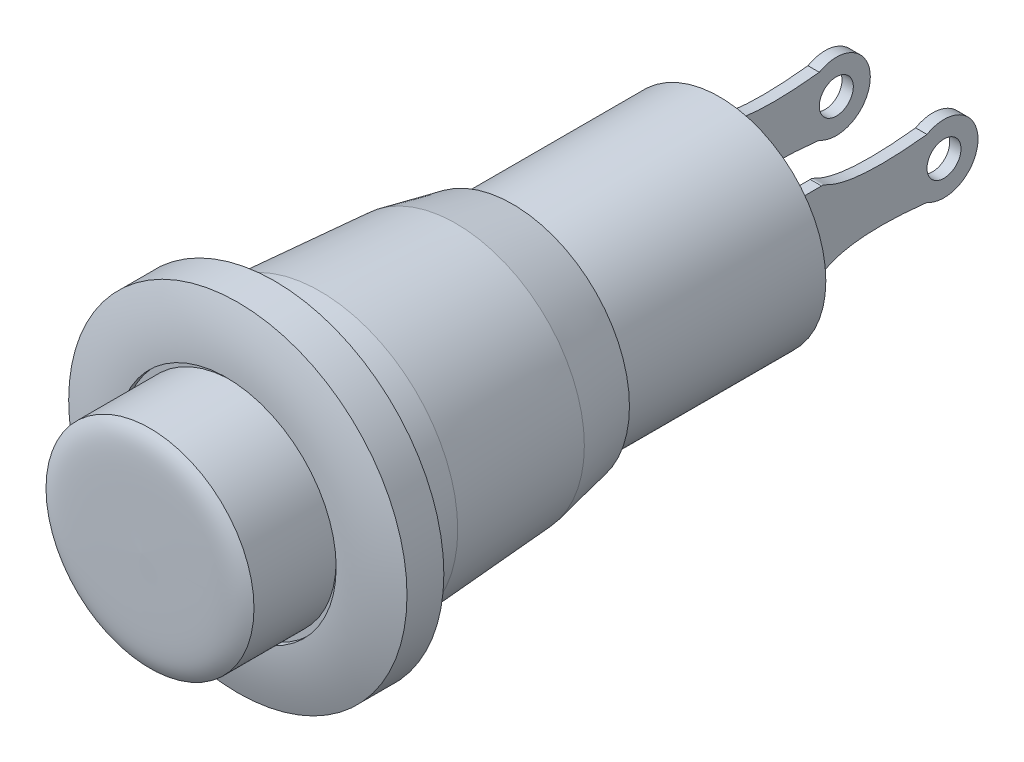
ISO-10303-21;
HEADER;
FILE_DESCRIPTION(('STEP AP214'),'2;1');
FILE_NAME('part.step','',(''),(''),'','','');
FILE_SCHEMA(('AUTOMOTIVE_DESIGN { 1 0 10303 214 1 1 1 1 }'));
ENDSEC;
DATA;
#1=APPLICATION_CONTEXT('core data for automotive mechanical design processes');
#2=APPLICATION_PROTOCOL_DEFINITION('international standard','automotive_design',2000,#1);
#3=PRODUCT_CONTEXT('',#1,'mechanical');
#4=PRODUCT('Part','Part','',(#3));
#5=PRODUCT_RELATED_PRODUCT_CATEGORY('part','',(#4));
#6=PRODUCT_DEFINITION_FORMATION('','',#4);
#7=PRODUCT_DEFINITION_CONTEXT('part definition',#1,'design');
#8=PRODUCT_DEFINITION('design','',#6,#7);
#9=PRODUCT_DEFINITION_SHAPE('','',#8);
#10=(LENGTH_UNIT() NAMED_UNIT(*) SI_UNIT(.MILLI.,.METRE.));
#11=(NAMED_UNIT(*) PLANE_ANGLE_UNIT() SI_UNIT($,.RADIAN.));
#12=(NAMED_UNIT(*) SI_UNIT($,.STERADIAN.) SOLID_ANGLE_UNIT());
#13=UNCERTAINTY_MEASURE_WITH_UNIT(LENGTH_MEASURE(1.E-05),#10,'distance_accuracy_value','');
#14=(GEOMETRIC_REPRESENTATION_CONTEXT(3) GLOBAL_UNCERTAINTY_ASSIGNED_CONTEXT((#13)) GLOBAL_UNIT_ASSIGNED_CONTEXT((#10,
#11,#12)) REPRESENTATION_CONTEXT('',''));
#15=CARTESIAN_POINT('',(0.,0.,0.));
#16=DIRECTION('',(0.,0.,1.));
#17=DIRECTION('',(1.,0.,0.));
#18=AXIS2_PLACEMENT_3D('',#15,#16,#17);
#19=CARTESIAN_POINT('',(-2.1,0.,-19.25615950335));
#20=DIRECTION('',(-1.,0.,0.));
#21=DIRECTION('',(0.,1.,0.));
#22=AXIS2_PLACEMENT_3D('',#19,#20,#21);
#23=PLANE('',#22);
#24=CARTESIAN_POINT('',(-2.1,0.,-21.52));
#25=DIRECTION('',(1.,0.,0.));
#26=DIRECTION('',(0.,1.,0.));
#27=AXIS2_PLACEMENT_3D('',#24,#25,#26);
#28=CIRCLE('',#27,0.6);
#29=CARTESIAN_POINT('',(-2.1,0.6,-21.52));
#30=VERTEX_POINT('',#29);
#31=EDGE_CURVE('P0_E10',#30,#30,#28,.T.);
#32=ORIENTED_EDGE('',*,*,#31,.T.);
#33=EDGE_LOOP('',(#32));
#34=FACE_BOUND('',#33,.T.);
#35=CARTESIAN_POINT('',(-2.1,-1.325,-17.2));
#36=CARTESIAN_POINT('',(-2.1,-1.393905,-17.370288));
#37=CARTESIAN_POINT('',(-2.1,-0.682112,-17.725716));
#38=CARTESIAN_POINT('',(-2.1,-1.039230484559,-20.91999999999));
#39=B_SPLINE_CURVE_WITH_KNOTS('',3,(#35,#36,#37,#38),.UNSPECIFIED.,.F.,.F.,(4,4),(0.,1.),.UNSPECIFIED.);
#40=CARTESIAN_POINT('',(-2.1,-1.325,-17.2));
#41=VERTEX_POINT('',#40);
#42=CARTESIAN_POINT('',(-2.1,-1.03923048455,-20.91999999999));
#43=VERTEX_POINT('',#42);
#44=EDGE_CURVE('P0_E19',#41,#43,#39,.T.);
#45=ORIENTED_EDGE('',*,*,#44,.F.);
#46=DIRECTION('',(0.,0.,-1.));
#47=VECTOR('',#46,1.);
#48=CARTESIAN_POINT('',(-2.1,-1.325,-15.7));
#49=LINE('',#48,#47);
#50=CARTESIAN_POINT('',(-2.1,-1.325,-15.7));
#51=VERTEX_POINT('',#50);
#52=EDGE_CURVE('P0_E146',#51,#41,#49,.T.);
#53=ORIENTED_EDGE('',*,*,#52,.F.);
#54=DIRECTION('',(0.,1.,0.));
#55=VECTOR('',#54,1.);
#56=CARTESIAN_POINT('',(-2.1,-1.325,-15.7));
#57=LINE('',#56,#55);
#58=CARTESIAN_POINT('',(-2.1,1.325,-15.7));
#59=VERTEX_POINT('',#58);
#60=EDGE_CURVE('P0_E134',#51,#59,#57,.T.);
#61=ORIENTED_EDGE('',*,*,#60,.T.);
#62=DIRECTION('',(0.,0.,-1.));
#63=VECTOR('',#62,1.);
#64=CARTESIAN_POINT('',(-2.1,1.325,-15.7));
#65=LINE('',#64,#63);
#66=CARTESIAN_POINT('',(-2.1,1.325,-17.2));
#67=VERTEX_POINT('',#66);
#68=EDGE_CURVE('P0_E74',#59,#67,#65,.T.);
#69=ORIENTED_EDGE('',*,*,#68,.T.);
#70=CARTESIAN_POINT('',(-2.1,1.325,-17.2));
#71=CARTESIAN_POINT('',(-2.1,1.393905,-17.370288));
#72=CARTESIAN_POINT('',(-2.1,0.682112,-17.725716));
#73=CARTESIAN_POINT('',(-2.1,1.039230484559,-20.91999999999));
#74=B_SPLINE_CURVE_WITH_KNOTS('',3,(#70,#71,#72,#73),.UNSPECIFIED.,.F.,.F.,(4,4),(0.,1.),.UNSPECIFIED.);
#75=CARTESIAN_POINT('',(-2.1,1.03923048455,-20.91999999999));
#76=VERTEX_POINT('',#75);
#77=EDGE_CURVE('P0_E118',#67,#76,#74,.T.);
#78=ORIENTED_EDGE('',*,*,#77,.T.);
#79=CARTESIAN_POINT('',(-2.1,0.,-21.52));
#80=DIRECTION('',(1.,0.,0.));
#81=DIRECTION('',(0.,1.,0.));
#82=AXIS2_PLACEMENT_3D('',#79,#80,#81);
#83=CIRCLE('',#82,1.2);
#84=EDGE_CURVE('P0_E105',#43,#76,#83,.T.);
#85=ORIENTED_EDGE('',*,*,#84,.F.);
#86=EDGE_LOOP('',(#45,#53,#61,#69,#78,#85));
#87=FACE_BOUND('',#86,.T.);
#88=ADVANCED_FACE('P0_F16',(#34,#87),#23,.T.);
#89=CARTESIAN_POINT('',(-1.7,0.,-19.25615950335));
#90=DIRECTION('',(-1.,0.,0.));
#91=DIRECTION('',(0.,1.,0.));
#92=AXIS2_PLACEMENT_3D('',#89,#90,#91);
#93=PLANE('',#92);
#94=CARTESIAN_POINT('',(-1.7,0.,-21.52));
#95=DIRECTION('',(1.,0.,0.));
#96=DIRECTION('',(0.,1.,0.));
#97=AXIS2_PLACEMENT_3D('',#94,#95,#96);
#98=CIRCLE('',#97,0.6);
#99=CARTESIAN_POINT('',(-1.7,0.6,-21.52));
#100=VERTEX_POINT('',#99);
#101=EDGE_CURVE('P0_E152',#100,#100,#98,.T.);
#102=ORIENTED_EDGE('',*,*,#101,.F.);
#103=EDGE_LOOP('',(#102));
#104=FACE_BOUND('',#103,.T.);
#105=CARTESIAN_POINT('',(-1.7,0.,-21.52));
#106=DIRECTION('',(1.,0.,0.));
#107=DIRECTION('',(0.,1.,0.));
#108=AXIS2_PLACEMENT_3D('',#105,#106,#107);
#109=CIRCLE('',#108,1.2);
#110=CARTESIAN_POINT('',(-1.7,-1.03923048455,-20.91999999999));
#111=VERTEX_POINT('',#110);
#112=CARTESIAN_POINT('',(-1.7,1.03923048455,-20.91999999999));
#113=VERTEX_POINT('',#112);
#114=EDGE_CURVE('P0_E117',#111,#113,#109,.T.);
#115=ORIENTED_EDGE('',*,*,#114,.T.);
#116=CARTESIAN_POINT('',(-1.7,1.325,-17.2));
#117=CARTESIAN_POINT('',(-1.7,1.393905,-17.370288));
#118=CARTESIAN_POINT('',(-1.7,0.682112,-17.725716));
#119=CARTESIAN_POINT('',(-1.7,1.039230484559,-20.91999999999));
#120=B_SPLINE_CURVE_WITH_KNOTS('',3,(#116,#117,#118,#119),.UNSPECIFIED.,.F.,.F.,(4,4),(0.,1.),.UNSPECIFIED.);
#121=CARTESIAN_POINT('',(-1.7,1.325,-17.2));
#122=VERTEX_POINT('',#121);
#123=EDGE_CURVE('P0_E64',#122,#113,#120,.T.);
#124=ORIENTED_EDGE('',*,*,#123,.F.);
#125=DIRECTION('',(0.,0.,-1.));
#126=VECTOR('',#125,1.);
#127=CARTESIAN_POINT('',(-1.7,1.325,-15.7));
#128=LINE('',#127,#126);
#129=CARTESIAN_POINT('',(-1.7,1.325,-15.7));
#130=VERTEX_POINT('',#129);
#131=EDGE_CURVE('P0_E82',#130,#122,#128,.T.);
#132=ORIENTED_EDGE('',*,*,#131,.F.);
#133=DIRECTION('',(0.,1.,0.));
#134=VECTOR('',#133,1.);
#135=CARTESIAN_POINT('',(-1.7,-1.325,-15.7));
#136=LINE('',#135,#134);
#137=CARTESIAN_POINT('',(-1.7,-1.325,-15.7));
#138=VERTEX_POINT('',#137);
#139=EDGE_CURVE('P0_E145',#138,#130,#136,.T.);
#140=ORIENTED_EDGE('',*,*,#139,.F.);
#141=DIRECTION('',(0.,0.,-1.));
#142=VECTOR('',#141,1.);
#143=CARTESIAN_POINT('',(-1.7,-1.325,-15.7));
#144=LINE('',#143,#142);
#145=CARTESIAN_POINT('',(-1.7,-1.325,-17.2));
#146=VERTEX_POINT('',#145);
#147=EDGE_CURVE('P0_E142',#138,#146,#144,.T.);
#148=ORIENTED_EDGE('',*,*,#147,.T.);
#149=CARTESIAN_POINT('',(-1.7,-1.325,-17.2));
#150=CARTESIAN_POINT('',(-1.7,-1.393905,-17.370288));
#151=CARTESIAN_POINT('',(-1.7,-0.682112,-17.725716));
#152=CARTESIAN_POINT('',(-1.7,-1.039230484559,-20.91999999999));
#153=B_SPLINE_CURVE_WITH_KNOTS('',3,(#149,#150,#151,#152),.UNSPECIFIED.,.F.,.F.,(4,4),(0.,1.),.UNSPECIFIED.);
#154=EDGE_CURVE('P0_E160',#146,#111,#153,.T.);
#155=ORIENTED_EDGE('',*,*,#154,.T.);
#156=EDGE_LOOP('',(#115,#124,#132,#140,#148,#155));
#157=FACE_BOUND('',#156,.T.);
#158=ADVANCED_FACE('P0_F202',(#104,#157),#93,.F.);
#159=CARTESIAN_POINT('',(-1.7,0.,-21.52));
#160=DIRECTION('',(1.,0.,0.));
#161=DIRECTION('',(0.,1.,0.));
#162=AXIS2_PLACEMENT_3D('',#159,#160,#161);
#163=CYLINDRICAL_SURFACE('',#162,0.6);
#164=ORIENTED_EDGE('',*,*,#101,.T.);
#165=DIRECTION('',(-1.,0.,0.));
#166=VECTOR('',#165,1.);
#167=CARTESIAN_POINT('',(-1.7,0.6,-21.52));
#168=LINE('',#167,#166);
#169=EDGE_CURVE('P0_E28',#100,#30,#168,.T.);
#170=ORIENTED_EDGE('',*,*,#169,.T.);
#171=ORIENTED_EDGE('',*,*,#31,.F.);
#172=ORIENTED_EDGE('',*,*,#169,.F.);
#173=EDGE_LOOP('',(#164,#170,#171,#172));
#174=FACE_BOUND('',#173,.T.);
#175=ADVANCED_FACE('P0_F204',(#174),#163,.F.);
#176=CARTESIAN_POINT('',(-1.7,0.,-21.52));
#177=DIRECTION('',(1.,0.,0.));
#178=DIRECTION('',(0.,1.,0.));
#179=AXIS2_PLACEMENT_3D('',#176,#177,#178);
#180=CYLINDRICAL_SURFACE('',#179,1.2);
#181=DIRECTION('',(-1.,0.,0.));
#182=VECTOR('',#181,1.);
#183=CARTESIAN_POINT('',(-1.7,-1.03923048455,-20.91999999999));
#184=LINE('',#183,#182);
#185=EDGE_CURVE('P0_E112',#111,#43,#184,.T.);
#186=ORIENTED_EDGE('',*,*,#185,.T.);
#187=ORIENTED_EDGE('',*,*,#84,.T.);
#188=DIRECTION('',(-1.,0.,0.));
#189=VECTOR('',#188,1.);
#190=CARTESIAN_POINT('',(-1.7,1.03923048455,-20.91999999999));
#191=LINE('',#190,#189);
#192=EDGE_CURVE('P0_E110',#113,#76,#191,.T.);
#193=ORIENTED_EDGE('',*,*,#192,.F.);
#194=ORIENTED_EDGE('',*,*,#114,.F.);
#195=EDGE_LOOP('',(#186,#187,#193,#194));
#196=FACE_BOUND('',#195,.T.);
#197=ADVANCED_FACE('P0_F107',(#196),#180,.T.);
#198=CARTESIAN_POINT('',(-1.7,1.325,-17.2));
#199=CARTESIAN_POINT('',(-1.7,1.393905,-17.370288));
#200=CARTESIAN_POINT('',(-1.7,0.682112,-17.725716));
#201=CARTESIAN_POINT('',(-1.7,1.039230484559,-20.91999999999));
#202=(BOUNDED_CURVE() B_SPLINE_CURVE(3,(#198,#199,#200,#201),.UNSPECIFIED.,.F.,
.F.) B_SPLINE_CURVE_WITH_KNOTS((4,4),(0.,1.),
.UNSPECIFIED.) CURVE() GEOMETRIC_REPRESENTATION_ITEM() RATIONAL_B_SPLINE_CURVE((1.,1.,1.,1.)) REPRESENTATION_ITEM(''));
#203=DIRECTION('',(1.,0.,0.));
#204=VECTOR('',#203,1.);
#205=SURFACE_OF_LINEAR_EXTRUSION('',#202,#204);
#206=ORIENTED_EDGE('',*,*,#123,.T.);
#207=ORIENTED_EDGE('',*,*,#192,.T.);
#208=ORIENTED_EDGE('',*,*,#77,.F.);
#209=DIRECTION('',(-1.,0.,0.));
#210=VECTOR('',#209,1.);
#211=CARTESIAN_POINT('',(-1.7,1.325,-17.2));
#212=LINE('',#211,#210);
#213=EDGE_CURVE('P0_E149',#122,#67,#212,.T.);
#214=ORIENTED_EDGE('',*,*,#213,.F.);
#215=EDGE_LOOP('',(#206,#207,#208,#214));
#216=FACE_BOUND('',#215,.T.);
#217=ADVANCED_FACE('P0_F123',(#216),#205,.F.);
#218=CARTESIAN_POINT('',(-1.7,1.325,-15.7));
#219=DIRECTION('',(0.,1.,0.));
#220=DIRECTION('',(1.,0.,0.));
#221=AXIS2_PLACEMENT_3D('',#218,#219,#220);
#222=PLANE('',#221);
#223=ORIENTED_EDGE('',*,*,#131,.T.);
#224=ORIENTED_EDGE('',*,*,#213,.T.);
#225=ORIENTED_EDGE('',*,*,#68,.F.);
#226=DIRECTION('',(-1.,0.,0.));
#227=VECTOR('',#226,1.);
#228=CARTESIAN_POINT('',(-1.7,1.325,-15.7));
#229=LINE('',#228,#227);
#230=EDGE_CURVE('P0_E137',#130,#59,#229,.T.);
#231=ORIENTED_EDGE('',*,*,#230,.F.);
#232=EDGE_LOOP('',(#223,#224,#225,#231));
#233=FACE_BOUND('',#232,.T.);
#234=ADVANCED_FACE('P0_F225',(#233),#222,.T.);
#235=CARTESIAN_POINT('',(-1.7,-1.325,-15.7));
#236=DIRECTION('',(0.,0.,1.));
#237=DIRECTION('',(0.,-1.,0.));
#238=AXIS2_PLACEMENT_3D('',#235,#236,#237);
#239=PLANE('',#238);
#240=ORIENTED_EDGE('',*,*,#139,.T.);
#241=ORIENTED_EDGE('',*,*,#230,.T.);
#242=ORIENTED_EDGE('',*,*,#60,.F.);
#243=DIRECTION('',(-1.,0.,0.));
#244=VECTOR('',#243,1.);
#245=CARTESIAN_POINT('',(-1.7,-1.325,-15.7));
#246=LINE('',#245,#244);
#247=EDGE_CURVE('P0_E133',#138,#51,#246,.T.);
#248=ORIENTED_EDGE('',*,*,#247,.F.);
#249=EDGE_LOOP('',(#240,#241,#242,#248));
#250=FACE_BOUND('',#249,.T.);
#251=ADVANCED_FACE('P0_F196',(#250),#239,.T.);
#252=CARTESIAN_POINT('',(-1.7,-1.325,-15.7));
#253=DIRECTION('',(0.,1.,0.));
#254=DIRECTION('',(1.,0.,0.));
#255=AXIS2_PLACEMENT_3D('',#252,#253,#254);
#256=PLANE('',#255);
#257=ORIENTED_EDGE('',*,*,#247,.T.);
#258=ORIENTED_EDGE('',*,*,#52,.T.);
#259=DIRECTION('',(-1.,0.,0.));
#260=VECTOR('',#259,1.);
#261=CARTESIAN_POINT('',(-1.7,-1.325,-17.2));
#262=LINE('',#261,#260);
#263=EDGE_CURVE('P0_E138',#146,#41,#262,.T.);
#264=ORIENTED_EDGE('',*,*,#263,.F.);
#265=ORIENTED_EDGE('',*,*,#147,.F.);
#266=EDGE_LOOP('',(#257,#258,#264,#265));
#267=FACE_BOUND('',#266,.T.);
#268=ADVANCED_FACE('P0_F192',(#267),#256,.F.);
#269=CARTESIAN_POINT('',(-1.7,-1.325,-17.2));
#270=CARTESIAN_POINT('',(-1.7,-1.393905,-17.370288));
#271=CARTESIAN_POINT('',(-1.7,-0.682112,-17.725716));
#272=CARTESIAN_POINT('',(-1.7,-1.039230484559,-20.91999999999));
#273=(BOUNDED_CURVE() B_SPLINE_CURVE(3,(#269,#270,#271,#272),.UNSPECIFIED.,.F.,
.F.) B_SPLINE_CURVE_WITH_KNOTS((4,4),(0.,1.),
.UNSPECIFIED.) CURVE() GEOMETRIC_REPRESENTATION_ITEM() RATIONAL_B_SPLINE_CURVE((1.,1.,1.,1.)) REPRESENTATION_ITEM(''));
#274=DIRECTION('',(1.,0.,0.));
#275=VECTOR('',#274,1.);
#276=SURFACE_OF_LINEAR_EXTRUSION('',#273,#275);
#277=ORIENTED_EDGE('',*,*,#263,.T.);
#278=ORIENTED_EDGE('',*,*,#44,.T.);
#279=ORIENTED_EDGE('',*,*,#185,.F.);
#280=ORIENTED_EDGE('',*,*,#154,.F.);
#281=EDGE_LOOP('',(#277,#278,#279,#280));
#282=FACE_BOUND('',#281,.T.);
#283=ADVANCED_FACE('P0_F200',(#282),#276,.T.);
#284=CLOSED_SHELL('',(#88,#158,#175,#197,#217,#234,#251,#268,#283));
#285=MANIFOLD_SOLID_BREP('P0_B1',#284);
#286=CARTESIAN_POINT('',(0.,0.,4.7));
#287=CARTESIAN_POINT('',(2.840957,0.,4.660466));
#288=CARTESIAN_POINT('',(3.116079,0.,4.739611));
#289=CARTESIAN_POINT('',(3.67,0.,4.4));
#290=(BOUNDED_CURVE() B_SPLINE_CURVE(3,(#286,#287,#288,#289),.UNSPECIFIED.,.F.,
.F.) B_SPLINE_CURVE_WITH_KNOTS((4,4),(0.,1.),
.UNSPECIFIED.) CURVE() GEOMETRIC_REPRESENTATION_ITEM() RATIONAL_B_SPLINE_CURVE((1.,1.,1.,1.)) REPRESENTATION_ITEM(''));
#291=CARTESIAN_POINT('',(0.,0.,0.));
#292=DIRECTION('',(0.,0.,1.));
#293=AXIS1_PLACEMENT('',#291,#292);
#294=SURFACE_OF_REVOLUTION('',#290,#293);
#295=CARTESIAN_POINT('',(0.,0.,4.7));
#296=CARTESIAN_POINT('',(2.840957,0.,4.660466));
#297=CARTESIAN_POINT('',(3.116079,0.,4.739611));
#298=CARTESIAN_POINT('',(3.67,0.,4.4));
#299=B_SPLINE_CURVE_WITH_KNOTS('',3,(#295,#296,#297,#298),.UNSPECIFIED.,.F.,.F.,(4,4),(0.,1.),.UNSPECIFIED.);
#300=CARTESIAN_POINT('',(0.,0.,4.7));
#301=VERTEX_POINT('',#300);
#302=CARTESIAN_POINT('',(3.67,0.,4.4));
#303=VERTEX_POINT('',#302);
#304=EDGE_CURVE('P1_E11',#301,#303,#299,.T.);
#305=ORIENTED_EDGE('',*,*,#304,.T.);
#306=CARTESIAN_POINT('',(0.,0.,4.4));
#307=DIRECTION('',(0.,0.,-1.));
#308=DIRECTION('',(1.,0.,0.));
#309=AXIS2_PLACEMENT_3D('',#306,#307,#308);
#310=CIRCLE('',#309,3.67);
#311=EDGE_CURVE('P1_E29',#303,#303,#310,.T.);
#312=ORIENTED_EDGE('',*,*,#311,.F.);
#313=ORIENTED_EDGE('',*,*,#304,.F.);
#314=EDGE_LOOP('',(#305,#312,#313));
#315=FACE_BOUND('',#314,.T.);
#316=ADVANCED_FACE('P1_F17',(#315),#294,.F.);
#317=CARTESIAN_POINT('',(0.,0.,1.5));
#318=DIRECTION('',(0.,0.,1.));
#319=DIRECTION('',(1.,0.,0.));
#320=AXIS2_PLACEMENT_3D('',#317,#318,#319);
#321=CYLINDRICAL_SURFACE('',#320,3.67);
#322=DIRECTION('',(0.,0.,1.));
#323=VECTOR('',#322,1.);
#324=CARTESIAN_POINT('',(3.67,0.,1.5));
#325=LINE('',#324,#323);
#326=CARTESIAN_POINT('',(3.67,0.,1.5));
#327=VERTEX_POINT('',#326);
#328=EDGE_CURVE('P1_E47',#327,#303,#325,.T.);
#329=ORIENTED_EDGE('',*,*,#328,.T.);
#330=ORIENTED_EDGE('',*,*,#311,.T.);
#331=ORIENTED_EDGE('',*,*,#328,.F.);
#332=CARTESIAN_POINT('',(0.,0.,1.5));
#333=DIRECTION('',(0.,0.,-1.));
#334=DIRECTION('',(1.,0.,0.));
#335=AXIS2_PLACEMENT_3D('',#332,#333,#334);
#336=CIRCLE('',#335,3.67);
#337=EDGE_CURVE('P1_E49',#327,#327,#336,.T.);
#338=ORIENTED_EDGE('',*,*,#337,.F.);
#339=EDGE_LOOP('',(#329,#330,#331,#338));
#340=FACE_BOUND('',#339,.T.);
#341=ADVANCED_FACE('P1_F19',(#340),#321,.T.);
#342=CARTESIAN_POINT('',(0.,0.,1.5));
#343=DIRECTION('',(0.,0.,-1.));
#344=DIRECTION('',(0.,-1.,0.));
#345=AXIS2_PLACEMENT_3D('',#342,#343,#344);
#346=PLANE('',#345);
#347=ORIENTED_EDGE('',*,*,#337,.T.);
#348=EDGE_LOOP('',(#347));
#349=FACE_BOUND('',#348,.T.);
#350=ADVANCED_FACE('P1_F53',(#349),#346,.T.);
#351=CLOSED_SHELL('',(#316,#341,#350));
#352=MANIFOLD_SOLID_BREP('P1_B1',#351);
#353=CARTESIAN_POINT('',(2.1,0.,-19.25615950335));
#354=DIRECTION('',(1.,0.,0.));
#355=DIRECTION('',(0.,-1.,0.));
#356=AXIS2_PLACEMENT_3D('',#353,#354,#355);
#357=PLANE('',#356);
#358=CARTESIAN_POINT('',(2.1,0.,-21.52));
#359=DIRECTION('',(1.,0.,0.));
#360=DIRECTION('',(0.,1.,0.));
#361=AXIS2_PLACEMENT_3D('',#358,#359,#360);
#362=CIRCLE('',#361,0.6);
#363=CARTESIAN_POINT('',(2.1,0.6,-21.52));
#364=VERTEX_POINT('',#363);
#365=EDGE_CURVE('P2_E30',#364,#364,#362,.T.);
#366=ORIENTED_EDGE('',*,*,#365,.F.);
#367=EDGE_LOOP('',(#366));
#368=FACE_BOUND('',#367,.T.);
#369=CARTESIAN_POINT('',(2.1,0.,-21.52));
#370=DIRECTION('',(1.,0.,0.));
#371=DIRECTION('',(0.,1.,0.));
#372=AXIS2_PLACEMENT_3D('',#369,#370,#371);
#373=CIRCLE('',#372,1.2);
#374=CARTESIAN_POINT('',(2.1,-1.03923048455,-20.91999999999));
#375=VERTEX_POINT('',#374);
#376=CARTESIAN_POINT('',(2.1,1.03923048455,-20.91999999999));
#377=VERTEX_POINT('',#376);
#378=EDGE_CURVE('P2_E128',#375,#377,#373,.T.);
#379=ORIENTED_EDGE('',*,*,#378,.T.);
#380=CARTESIAN_POINT('',(2.1,1.325,-17.2));
#381=CARTESIAN_POINT('',(2.1,1.393905,-17.370288));
#382=CARTESIAN_POINT('',(2.1,0.682112,-17.725716));
#383=CARTESIAN_POINT('',(2.1,1.039230484559,-20.91999999999));
#384=B_SPLINE_CURVE_WITH_KNOTS('',3,(#380,#381,#382,#383),.UNSPECIFIED.,.F.,.F.,(4,4),(0.,1.),.UNSPECIFIED.);
#385=CARTESIAN_POINT('',(2.1,1.325,-17.2));
#386=VERTEX_POINT('',#385);
#387=EDGE_CURVE('P2_E135',#386,#377,#384,.T.);
#388=ORIENTED_EDGE('',*,*,#387,.F.);
#389=DIRECTION('',(0.,0.,-1.));
#390=VECTOR('',#389,1.);
#391=CARTESIAN_POINT('',(2.1,1.325,-15.7));
#392=LINE('',#391,#390);
#393=CARTESIAN_POINT('',(2.1,1.325,-15.7));
#394=VERTEX_POINT('',#393);
#395=EDGE_CURVE('P2_E168',#394,#386,#392,.T.);
#396=ORIENTED_EDGE('',*,*,#395,.F.);
#397=DIRECTION('',(0.,1.,0.));
#398=VECTOR('',#397,1.);
#399=CARTESIAN_POINT('',(2.1,-1.325,-15.7));
#400=LINE('',#399,#398);
#401=CARTESIAN_POINT('',(2.1,-1.325,-15.7));
#402=VERTEX_POINT('',#401);
#403=EDGE_CURVE('P2_E175',#402,#394,#400,.T.);
#404=ORIENTED_EDGE('',*,*,#403,.F.);
#405=DIRECTION('',(0.,0.,-1.));
#406=VECTOR('',#405,1.);
#407=CARTESIAN_POINT('',(2.1,-1.325,-15.7));
#408=LINE('',#407,#406);
#409=CARTESIAN_POINT('',(2.1,-1.325,-17.2));
#410=VERTEX_POINT('',#409);
#411=EDGE_CURVE('P2_E103',#402,#410,#408,.T.);
#412=ORIENTED_EDGE('',*,*,#411,.T.);
#413=CARTESIAN_POINT('',(2.1,-1.325,-17.2));
#414=CARTESIAN_POINT('',(2.1,-1.393905,-17.370288));
#415=CARTESIAN_POINT('',(2.1,-0.682112,-17.725716));
#416=CARTESIAN_POINT('',(2.1,-1.039230484559,-20.91999999999));
#417=B_SPLINE_CURVE_WITH_KNOTS('',3,(#413,#414,#415,#416),.UNSPECIFIED.,.F.,.F.,(4,4),(0.,1.),.UNSPECIFIED.);
#418=EDGE_CURVE('P2_E109',#410,#375,#417,.T.);
#419=ORIENTED_EDGE('',*,*,#418,.T.);
#420=EDGE_LOOP('',(#379,#388,#396,#404,#412,#419));
#421=FACE_BOUND('',#420,.T.);
#422=ADVANCED_FACE('P2_F17',(#368,#421),#357,.T.);
#423=CARTESIAN_POINT('',(1.7,0.,-19.25615950335));
#424=DIRECTION('',(1.,0.,0.));
#425=DIRECTION('',(0.,-1.,0.));
#426=AXIS2_PLACEMENT_3D('',#423,#424,#425);
#427=PLANE('',#426);
#428=CARTESIAN_POINT('',(1.7,0.,-21.52));
#429=DIRECTION('',(1.,0.,0.));
#430=DIRECTION('',(0.,1.,0.));
#431=AXIS2_PLACEMENT_3D('',#428,#429,#430);
#432=CIRCLE('',#431,0.6);
#433=CARTESIAN_POINT('',(1.7,0.6,-21.52));
#434=VERTEX_POINT('',#433);
#435=EDGE_CURVE('P2_E11',#434,#434,#432,.T.);
#436=ORIENTED_EDGE('',*,*,#435,.T.);
#437=EDGE_LOOP('',(#436));
#438=FACE_BOUND('',#437,.T.);
#439=CARTESIAN_POINT('',(1.7,-1.325,-17.2));
#440=CARTESIAN_POINT('',(1.7,-1.393905,-17.370288));
#441=CARTESIAN_POINT('',(1.7,-0.682112,-17.725716));
#442=CARTESIAN_POINT('',(1.7,-1.039230484559,-20.91999999999));
#443=B_SPLINE_CURVE_WITH_KNOTS('',3,(#439,#440,#441,#442),.UNSPECIFIED.,.F.,.F.,(4,4),(0.,1.),.UNSPECIFIED.);
#444=CARTESIAN_POINT('',(1.7,-1.325,-17.2));
#445=VERTEX_POINT('',#444);
#446=CARTESIAN_POINT('',(1.7,-1.03923048455,-20.91999999999));
#447=VERTEX_POINT('',#446);
#448=EDGE_CURVE('P2_E22',#445,#447,#443,.T.);
#449=ORIENTED_EDGE('',*,*,#448,.F.);
#450=DIRECTION('',(0.,0.,-1.));
#451=VECTOR('',#450,1.);
#452=CARTESIAN_POINT('',(1.7,-1.325,-15.7));
#453=LINE('',#452,#451);
#454=CARTESIAN_POINT('',(1.7,-1.325,-15.7));
#455=VERTEX_POINT('',#454);
#456=EDGE_CURVE('P2_E91',#455,#445,#453,.T.);
#457=ORIENTED_EDGE('',*,*,#456,.F.);
#458=DIRECTION('',(0.,1.,0.));
#459=VECTOR('',#458,1.);
#460=CARTESIAN_POINT('',(1.7,-1.325,-15.7));
#461=LINE('',#460,#459);
#462=CARTESIAN_POINT('',(1.7,1.325,-15.7));
#463=VERTEX_POINT('',#462);
#464=EDGE_CURVE('P2_E181',#455,#463,#461,.T.);
#465=ORIENTED_EDGE('',*,*,#464,.T.);
#466=DIRECTION('',(0.,0.,-1.));
#467=VECTOR('',#466,1.);
#468=CARTESIAN_POINT('',(1.7,1.325,-15.7));
#469=LINE('',#468,#467);
#470=CARTESIAN_POINT('',(1.7,1.325,-17.2));
#471=VERTEX_POINT('',#470);
#472=EDGE_CURVE('P2_E143',#463,#471,#469,.T.);
#473=ORIENTED_EDGE('',*,*,#472,.T.);
#474=CARTESIAN_POINT('',(1.7,1.325,-17.2));
#475=CARTESIAN_POINT('',(1.7,1.393905,-17.370288));
#476=CARTESIAN_POINT('',(1.7,0.682112,-17.725716));
#477=CARTESIAN_POINT('',(1.7,1.039230484559,-20.91999999999));
#478=B_SPLINE_CURVE_WITH_KNOTS('',3,(#474,#475,#476,#477),.UNSPECIFIED.,.F.,.F.,(4,4),(0.,1.),.UNSPECIFIED.);
#479=CARTESIAN_POINT('',(1.7,1.03923048455,-20.91999999999));
#480=VERTEX_POINT('',#479);
#481=EDGE_CURVE('P2_E129',#471,#480,#478,.T.);
#482=ORIENTED_EDGE('',*,*,#481,.T.);
#483=CARTESIAN_POINT('',(1.7,0.,-21.52));
#484=DIRECTION('',(1.,0.,0.));
#485=DIRECTION('',(0.,1.,0.));
#486=AXIS2_PLACEMENT_3D('',#483,#484,#485);
#487=CIRCLE('',#486,1.2);
#488=EDGE_CURVE('P2_E114',#447,#480,#487,.T.);
#489=ORIENTED_EDGE('',*,*,#488,.F.);
#490=EDGE_LOOP('',(#449,#457,#465,#473,#482,#489));
#491=FACE_BOUND('',#490,.T.);
#492=ADVANCED_FACE('P2_F112',(#438,#491),#427,.F.);
#493=CARTESIAN_POINT('',(1.7,0.,-21.52));
#494=DIRECTION('',(-1.,0.,0.));
#495=DIRECTION('',(0.,1.,0.));
#496=AXIS2_PLACEMENT_3D('',#493,#494,#495);
#497=CYLINDRICAL_SURFACE('',#496,0.6);
#498=DIRECTION('',(1.,0.,0.));
#499=VECTOR('',#498,1.);
#500=CARTESIAN_POINT('',(1.7,0.6,-21.52));
#501=LINE('',#500,#499);
#502=EDGE_CURVE('P2_E182',#434,#364,#501,.T.);
#503=ORIENTED_EDGE('',*,*,#502,.T.);
#504=ORIENTED_EDGE('',*,*,#365,.T.);
#505=ORIENTED_EDGE('',*,*,#502,.F.);
#506=ORIENTED_EDGE('',*,*,#435,.F.);
#507=EDGE_LOOP('',(#503,#504,#505,#506));
#508=FACE_BOUND('',#507,.T.);
#509=ADVANCED_FACE('P2_F238',(#508),#497,.F.);
#510=CARTESIAN_POINT('',(1.7,0.,-21.52));
#511=DIRECTION('',(-1.,0.,0.));
#512=DIRECTION('',(0.,1.,0.));
#513=AXIS2_PLACEMENT_3D('',#510,#511,#512);
#514=CYLINDRICAL_SURFACE('',#513,1.2);
#515=ORIENTED_EDGE('',*,*,#488,.T.);
#516=DIRECTION('',(1.,0.,0.));
#517=VECTOR('',#516,1.);
#518=CARTESIAN_POINT('',(1.7,1.03923048455,-20.91999999999));
#519=LINE('',#518,#517);
#520=EDGE_CURVE('P2_E134',#480,#377,#519,.T.);
#521=ORIENTED_EDGE('',*,*,#520,.T.);
#522=ORIENTED_EDGE('',*,*,#378,.F.);
#523=DIRECTION('',(1.,0.,0.));
#524=VECTOR('',#523,1.);
#525=CARTESIAN_POINT('',(1.7,-1.03923048455,-20.91999999999));
#526=LINE('',#525,#524);
#527=EDGE_CURVE('P2_E117',#447,#375,#526,.T.);
#528=ORIENTED_EDGE('',*,*,#527,.F.);
#529=EDGE_LOOP('',(#515,#521,#522,#528));
#530=FACE_BOUND('',#529,.T.);
#531=ADVANCED_FACE('P2_F196',(#530),#514,.T.);
#532=CARTESIAN_POINT('',(1.7,1.325,-17.2));
#533=CARTESIAN_POINT('',(1.7,1.393905,-17.370288));
#534=CARTESIAN_POINT('',(1.7,0.682112,-17.725716));
#535=CARTESIAN_POINT('',(1.7,1.039230484559,-20.91999999999));
#536=(BOUNDED_CURVE() B_SPLINE_CURVE(3,(#532,#533,#534,#535),.UNSPECIFIED.,.F.,
.F.) B_SPLINE_CURVE_WITH_KNOTS((4,4),(0.,1.),
.UNSPECIFIED.) CURVE() GEOMETRIC_REPRESENTATION_ITEM() RATIONAL_B_SPLINE_CURVE((1.,1.,1.,1.)) REPRESENTATION_ITEM(''));
#537=DIRECTION('',(-1.,0.,0.));
#538=VECTOR('',#537,1.);
#539=SURFACE_OF_LINEAR_EXTRUSION('',#536,#538);
#540=DIRECTION('',(1.,0.,0.));
#541=VECTOR('',#540,1.);
#542=CARTESIAN_POINT('',(1.7,1.325,-17.2));
#543=LINE('',#542,#541);
#544=EDGE_CURVE('P2_E162',#471,#386,#543,.T.);
#545=ORIENTED_EDGE('',*,*,#544,.T.);
#546=ORIENTED_EDGE('',*,*,#387,.T.);
#547=ORIENTED_EDGE('',*,*,#520,.F.);
#548=ORIENTED_EDGE('',*,*,#481,.F.);
#549=EDGE_LOOP('',(#545,#546,#547,#548));
#550=FACE_BOUND('',#549,.T.);
#551=ADVANCED_FACE('P2_F198',(#550),#539,.T.);
#552=CARTESIAN_POINT('',(1.7,1.325,-15.7));
#553=DIRECTION('',(0.,1.,0.));
#554=DIRECTION('',(1.,0.,0.));
#555=AXIS2_PLACEMENT_3D('',#552,#553,#554);
#556=PLANE('',#555);
#557=DIRECTION('',(1.,0.,0.));
#558=VECTOR('',#557,1.);
#559=CARTESIAN_POINT('',(1.7,1.325,-15.7));
#560=LINE('',#559,#558);
#561=EDGE_CURVE('P2_E177',#463,#394,#560,.T.);
#562=ORIENTED_EDGE('',*,*,#561,.T.);
#563=ORIENTED_EDGE('',*,*,#395,.T.);
#564=ORIENTED_EDGE('',*,*,#544,.F.);
#565=ORIENTED_EDGE('',*,*,#472,.F.);
#566=EDGE_LOOP('',(#562,#563,#564,#565));
#567=FACE_BOUND('',#566,.T.);
#568=ADVANCED_FACE('P2_F235',(#567),#556,.T.);
#569=CARTESIAN_POINT('',(1.7,-1.325,-15.7));
#570=DIRECTION('',(0.,0.,1.));
#571=DIRECTION('',(0.,-1.,0.));
#572=AXIS2_PLACEMENT_3D('',#569,#570,#571);
#573=PLANE('',#572);
#574=DIRECTION('',(1.,0.,0.));
#575=VECTOR('',#574,1.);
#576=CARTESIAN_POINT('',(1.7,-1.325,-15.7));
#577=LINE('',#576,#575);
#578=EDGE_CURVE('P2_E98',#455,#402,#577,.T.);
#579=ORIENTED_EDGE('',*,*,#578,.T.);
#580=ORIENTED_EDGE('',*,*,#403,.T.);
#581=ORIENTED_EDGE('',*,*,#561,.F.);
#582=ORIENTED_EDGE('',*,*,#464,.F.);
#583=EDGE_LOOP('',(#579,#580,#581,#582));
#584=FACE_BOUND('',#583,.T.);
#585=ADVANCED_FACE('P2_F211',(#584),#573,.T.);
#586=CARTESIAN_POINT('',(1.7,-1.325,-15.7));
#587=DIRECTION('',(0.,1.,0.));
#588=DIRECTION('',(1.,0.,0.));
#589=AXIS2_PLACEMENT_3D('',#586,#587,#588);
#590=PLANE('',#589);
#591=ORIENTED_EDGE('',*,*,#456,.T.);
#592=DIRECTION('',(1.,0.,0.));
#593=VECTOR('',#592,1.);
#594=CARTESIAN_POINT('',(1.7,-1.325,-17.2));
#595=LINE('',#594,#593);
#596=EDGE_CURVE('P2_E95',#445,#410,#595,.T.);
#597=ORIENTED_EDGE('',*,*,#596,.T.);
#598=ORIENTED_EDGE('',*,*,#411,.F.);
#599=ORIENTED_EDGE('',*,*,#578,.F.);
#600=EDGE_LOOP('',(#591,#597,#598,#599));
#601=FACE_BOUND('',#600,.T.);
#602=ADVANCED_FACE('P2_F93',(#601),#590,.F.);
#603=CARTESIAN_POINT('',(1.7,-1.325,-17.2));
#604=CARTESIAN_POINT('',(1.7,-1.393905,-17.370288));
#605=CARTESIAN_POINT('',(1.7,-0.682112,-17.725716));
#606=CARTESIAN_POINT('',(1.7,-1.039230484559,-20.91999999999));
#607=(BOUNDED_CURVE() B_SPLINE_CURVE(3,(#603,#604,#605,#606),.UNSPECIFIED.,.F.,
.F.) B_SPLINE_CURVE_WITH_KNOTS((4,4),(0.,1.),
.UNSPECIFIED.) CURVE() GEOMETRIC_REPRESENTATION_ITEM() RATIONAL_B_SPLINE_CURVE((1.,1.,1.,1.)) REPRESENTATION_ITEM(''));
#608=DIRECTION('',(-1.,0.,0.));
#609=VECTOR('',#608,1.);
#610=SURFACE_OF_LINEAR_EXTRUSION('',#607,#609);
#611=ORIENTED_EDGE('',*,*,#448,.T.);
#612=ORIENTED_EDGE('',*,*,#527,.T.);
#613=ORIENTED_EDGE('',*,*,#418,.F.);
#614=ORIENTED_EDGE('',*,*,#596,.F.);
#615=EDGE_LOOP('',(#611,#612,#613,#614));
#616=FACE_BOUND('',#615,.T.);
#617=ADVANCED_FACE('P2_F19',(#616),#610,.F.);
#618=CLOSED_SHELL('',(#422,#492,#509,#531,#551,#568,#585,#602,#617));
#619=MANIFOLD_SOLID_BREP('P2_B1',#618);
#620=CARTESIAN_POINT('',(0.,0.,0.));
#621=DIRECTION('',(0.,0.,-1.));
#622=DIRECTION('',(0.,-1.,0.));
#623=AXIS2_PLACEMENT_3D('',#620,#621,#622);
#624=PLANE('',#623);
#625=CARTESIAN_POINT('',(0.,0.,0.));
#626=DIRECTION('',(0.,0.,-1.));
#627=DIRECTION('',(1.,0.,0.));
#628=AXIS2_PLACEMENT_3D('',#625,#626,#627);
#629=CIRCLE('',#628,5.97);
#630=CARTESIAN_POINT('',(5.97,0.,0.));
#631=VERTEX_POINT('',#630);
#632=EDGE_CURVE('P3_E11',#631,#631,#629,.T.);
#633=ORIENTED_EDGE('',*,*,#632,.T.);
#634=EDGE_LOOP('',(#633));
#635=FACE_BOUND('',#634,.T.);
#636=CARTESIAN_POINT('',(0.,0.,0.));
#637=DIRECTION('',(0.,0.,-1.));
#638=DIRECTION('',(1.,0.,0.));
#639=AXIS2_PLACEMENT_3D('',#636,#637,#638);
#640=CIRCLE('',#639,4.86);
#641=CARTESIAN_POINT('',(4.86,0.,0.));
#642=VERTEX_POINT('',#641);
#643=EDGE_CURVE('P3_E122',#642,#642,#640,.T.);
#644=ORIENTED_EDGE('',*,*,#643,.F.);
#645=EDGE_LOOP('',(#644));
#646=FACE_BOUND('',#645,.T.);
#647=ADVANCED_FACE('P3_F17',(#635,#646),#624,.T.);
#648=CARTESIAN_POINT('',(0.,0.,0.));
#649=DIRECTION('',(0.,0.,1.));
#650=DIRECTION('',(1.,0.,0.));
#651=AXIS2_PLACEMENT_3D('',#648,#649,#650);
#652=CYLINDRICAL_SURFACE('',#651,5.97);
#653=DIRECTION('',(0.,0.,1.));
#654=VECTOR('',#653,1.);
#655=CARTESIAN_POINT('',(5.97,0.,0.));
#656=LINE('',#655,#654);
#657=CARTESIAN_POINT('',(5.97,0.,1.3));
#658=VERTEX_POINT('',#657);
#659=EDGE_CURVE('P3_E30',#631,#658,#656,.T.);
#660=ORIENTED_EDGE('',*,*,#659,.T.);
#661=CARTESIAN_POINT('',(0.,0.,1.3));
#662=DIRECTION('',(0.,0.,-1.));
#663=DIRECTION('',(1.,0.,0.));
#664=AXIS2_PLACEMENT_3D('',#661,#662,#663);
#665=CIRCLE('',#664,5.97);
#666=EDGE_CURVE('P3_E88',#658,#658,#665,.T.);
#667=ORIENTED_EDGE('',*,*,#666,.T.);
#668=ORIENTED_EDGE('',*,*,#659,.F.);
#669=ORIENTED_EDGE('',*,*,#632,.F.);
#670=EDGE_LOOP('',(#660,#667,#668,#669));
#671=FACE_BOUND('',#670,.T.);
#672=ADVANCED_FACE('P3_F146',(#671),#652,.T.);
#673=CARTESIAN_POINT('',(5.97,0.,1.3));
#674=CARTESIAN_POINT('',(5.228282,0.,1.55027));
#675=CARTESIAN_POINT('',(4.563405,0.,1.69852));
#676=CARTESIAN_POINT('',(3.87,0.,1.7));
#677=(BOUNDED_CURVE() B_SPLINE_CURVE(3,(#673,#674,#675,#676),.UNSPECIFIED.,.F.,
.F.) B_SPLINE_CURVE_WITH_KNOTS((4,4),(0.,1.),
.UNSPECIFIED.) CURVE() GEOMETRIC_REPRESENTATION_ITEM() RATIONAL_B_SPLINE_CURVE((1.,1.,1.,1.)) REPRESENTATION_ITEM(''));
#678=CARTESIAN_POINT('',(0.,0.,0.));
#679=DIRECTION('',(0.,0.,1.));
#680=AXIS1_PLACEMENT('',#678,#679);
#681=SURFACE_OF_REVOLUTION('',#677,#680);
#682=CARTESIAN_POINT('',(5.97,0.,1.3));
#683=CARTESIAN_POINT('',(5.228282,0.,1.55027));
#684=CARTESIAN_POINT('',(4.563405,0.,1.69852));
#685=CARTESIAN_POINT('',(3.87,0.,1.7));
#686=B_SPLINE_CURVE_WITH_KNOTS('',3,(#682,#683,#684,#685),.UNSPECIFIED.,.F.,.F.,(4,4),(0.,1.),.UNSPECIFIED.);
#687=CARTESIAN_POINT('',(3.87,0.,1.7));
#688=VERTEX_POINT('',#687);
#689=EDGE_CURVE('P3_E21',#658,#688,#686,.T.);
#690=ORIENTED_EDGE('',*,*,#689,.T.);
#691=CARTESIAN_POINT('',(0.,0.,1.7));
#692=DIRECTION('',(0.,0.,-1.));
#693=DIRECTION('',(1.,0.,0.));
#694=AXIS2_PLACEMENT_3D('',#691,#692,#693);
#695=CIRCLE('',#694,3.87);
#696=EDGE_CURVE('P3_E86',#688,#688,#695,.T.);
#697=ORIENTED_EDGE('',*,*,#696,.T.);
#698=ORIENTED_EDGE('',*,*,#689,.F.);
#699=ORIENTED_EDGE('',*,*,#666,.F.);
#700=EDGE_LOOP('',(#690,#697,#698,#699));
#701=FACE_BOUND('',#700,.T.);
#702=ADVANCED_FACE('P3_F84',(#701),#681,.T.);
#703=CARTESIAN_POINT('',(0.,0.,1.7));
#704=DIRECTION('',(0.,0.,-1.));
#705=DIRECTION('',(1.,0.,0.));
#706=AXIS2_PLACEMENT_3D('',#703,#704,#705);
#707=CYLINDRICAL_SURFACE('',#706,3.87);
#708=DIRECTION('',(0.,0.,-1.));
#709=VECTOR('',#708,1.);
#710=CARTESIAN_POINT('',(3.87,0.,1.7));
#711=LINE('',#710,#709);
#712=CARTESIAN_POINT('',(3.87,0.,1.5));
#713=VERTEX_POINT('',#712);
#714=EDGE_CURVE('P3_E96',#688,#713,#711,.T.);
#715=ORIENTED_EDGE('',*,*,#714,.T.);
#716=CARTESIAN_POINT('',(0.,0.,1.5));
#717=DIRECTION('',(0.,0.,-1.));
#718=DIRECTION('',(1.,0.,0.));
#719=AXIS2_PLACEMENT_3D('',#716,#717,#718);
#720=CIRCLE('',#719,3.87);
#721=EDGE_CURVE('P3_E101',#713,#713,#720,.T.);
#722=ORIENTED_EDGE('',*,*,#721,.T.);
#723=ORIENTED_EDGE('',*,*,#714,.F.);
#724=ORIENTED_EDGE('',*,*,#696,.F.);
#725=EDGE_LOOP('',(#715,#722,#723,#724));
#726=FACE_BOUND('',#725,.T.);
#727=ADVANCED_FACE('P3_F145',(#726),#707,.F.);
#728=CARTESIAN_POINT('',(0.,0.,1.5));
#729=DIRECTION('',(0.,0.,-1.));
#730=DIRECTION('',(0.,-1.,0.));
#731=AXIS2_PLACEMENT_3D('',#728,#729,#730);
#732=PLANE('',#731);
#733=ORIENTED_EDGE('',*,*,#721,.F.);
#734=EDGE_LOOP('',(#733));
#735=FACE_BOUND('',#734,.T.);
#736=ADVANCED_FACE('P3_F151',(#735),#732,.F.);
#737=CARTESIAN_POINT('',(0.,0.,-8.4));
#738=DIRECTION('',(0.,0.,-1.));
#739=DIRECTION('',(0.,-1.,0.));
#740=AXIS2_PLACEMENT_3D('',#737,#738,#739);
#741=PLANE('',#740);
#742=CARTESIAN_POINT('',(0.,0.,-8.4));
#743=DIRECTION('',(0.,0.,-1.));
#744=DIRECTION('',(1.,0.,0.));
#745=AXIS2_PLACEMENT_3D('',#742,#743,#744);
#746=CIRCLE('',#745,3.75);
#747=CARTESIAN_POINT('',(3.75,0.,-8.4));
#748=VERTEX_POINT('',#747);
#749=EDGE_CURVE('P3_E108',#748,#748,#746,.T.);
#750=ORIENTED_EDGE('',*,*,#749,.T.);
#751=EDGE_LOOP('',(#750));
#752=FACE_BOUND('',#751,.T.);
#753=ADVANCED_FACE('P3_F147',(#752),#741,.T.);
#754=CARTESIAN_POINT('',(0.,0.,-8.4));
#755=DIRECTION('',(0.,0.,-1.));
#756=DIRECTION('',(0.,-1.,0.));
#757=AXIS2_PLACEMENT_3D('',#754,#755,#756);
#758=PLANE('',#757);
#759=ORIENTED_EDGE('',*,*,#749,.F.);
#760=EDGE_LOOP('',(#759));
#761=FACE_BOUND('',#760,.T.);
#762=CARTESIAN_POINT('',(0.,0.,-8.4));
#763=DIRECTION('',(0.,0.,-1.));
#764=DIRECTION('',(1.,0.,0.));
#765=AXIS2_PLACEMENT_3D('',#762,#763,#764);
#766=CIRCLE('',#765,4.12);
#767=CARTESIAN_POINT('',(4.12,0.,-8.4));
#768=VERTEX_POINT('',#767);
#769=EDGE_CURVE('P3_E106',#768,#768,#766,.T.);
#770=ORIENTED_EDGE('',*,*,#769,.T.);
#771=EDGE_LOOP('',(#770));
#772=FACE_BOUND('',#771,.T.);
#773=ADVANCED_FACE('P3_F150',(#761,#772),#758,.T.);
#774=CARTESIAN_POINT('',(0.,0.,-6.4));
#775=DIRECTION('',(0.,0.,1.));
#776=DIRECTION('',(1.,0.,0.));
#777=AXIS2_PLACEMENT_3D('',#774,#775,#776);
#778=CONICAL_SURFACE('',#777,4.528419636423,0.20144016547);
#779=CARTESIAN_POINT('',(0.,0.,-6.4));
#780=DIRECTION('',(0.,0.,-1.));
#781=DIRECTION('',(1.,0.,0.));
#782=AXIS2_PLACEMENT_3D('',#779,#780,#781);
#783=CIRCLE('',#782,4.528419636423);
#784=CARTESIAN_POINT('',(4.528419636423,0.,-6.4));
#785=VERTEX_POINT('',#784);
#786=EDGE_CURVE('P3_E111',#785,#785,#783,.T.);
#787=ORIENTED_EDGE('',*,*,#786,.T.);
#788=DIRECTION('',(-0.200080582322928,0.,-0.979779444863648));
#789=VECTOR('',#788,1.);
#790=CARTESIAN_POINT('',(4.528419636423,0.,-6.4));
#791=LINE('',#790,#789);
#792=EDGE_CURVE('P3_E109',#785,#768,#791,.T.);
#793=ORIENTED_EDGE('',*,*,#792,.T.);
#794=ORIENTED_EDGE('',*,*,#769,.F.);
#795=ORIENTED_EDGE('',*,*,#792,.F.);
#796=EDGE_LOOP('',(#787,#793,#794,#795));
#797=FACE_BOUND('',#796,.T.);
#798=ADVANCED_FACE('P3_F156',(#797),#778,.T.);
#799=CARTESIAN_POINT('',(0.,0.,-1.6));
#800=DIRECTION('',(0.,0.,1.));
#801=DIRECTION('',(1.,0.,0.));
#802=AXIS2_PLACEMENT_3D('',#799,#800,#801);
#803=CONICAL_SURFACE('',#802,4.86,0.0689696752434897);
#804=CARTESIAN_POINT('',(0.,0.,-1.6));
#805=DIRECTION('',(0.,0.,-1.));
#806=DIRECTION('',(1.,0.,0.));
#807=AXIS2_PLACEMENT_3D('',#804,#805,#806);
#808=CIRCLE('',#807,4.86);
#809=CARTESIAN_POINT('',(4.86,0.,-1.6));
#810=VERTEX_POINT('',#809);
#811=EDGE_CURVE('P3_E112',#810,#810,#808,.T.);
#812=ORIENTED_EDGE('',*,*,#811,.T.);
#813=DIRECTION('',(-0.0689150089033647,0.,-0.997622534603068));
#814=VECTOR('',#813,1.);
#815=CARTESIAN_POINT('',(4.86,0.,-1.6));
#816=LINE('',#815,#814);
#817=EDGE_CURVE('P3_E61',#810,#785,#816,.T.);
#818=ORIENTED_EDGE('',*,*,#817,.T.);
#819=ORIENTED_EDGE('',*,*,#786,.F.);
#820=ORIENTED_EDGE('',*,*,#817,.F.);
#821=EDGE_LOOP('',(#812,#818,#819,#820));
#822=FACE_BOUND('',#821,.T.);
#823=ADVANCED_FACE('P3_F159',(#822),#803,.T.);
#824=CARTESIAN_POINT('',(0.,0.,0.));
#825=DIRECTION('',(0.,0.,-1.));
#826=DIRECTION('',(1.,0.,0.));
#827=AXIS2_PLACEMENT_3D('',#824,#825,#826);
#828=CYLINDRICAL_SURFACE('',#827,4.86);
#829=ORIENTED_EDGE('',*,*,#643,.T.);
#830=DIRECTION('',(0.,0.,-1.));
#831=VECTOR('',#830,1.);
#832=CARTESIAN_POINT('',(4.86,0.,0.));
#833=LINE('',#832,#831);
#834=EDGE_CURVE('P3_E72',#642,#810,#833,.T.);
#835=ORIENTED_EDGE('',*,*,#834,.T.);
#836=ORIENTED_EDGE('',*,*,#811,.F.);
#837=ORIENTED_EDGE('',*,*,#834,.F.);
#838=EDGE_LOOP('',(#829,#835,#836,#837));
#839=FACE_BOUND('',#838,.T.);
#840=ADVANCED_FACE('P3_F19',(#839),#828,.T.);
#841=CLOSED_SHELL('',(#647,#672,#702,#727,#736,#753,#773,#798,#823,#840));
#842=MANIFOLD_SOLID_BREP('P3_B1',#841);
#843=CARTESIAN_POINT('',(0.,0.,-15.7));
#844=DIRECTION('',(0.,0.,1.));
#845=DIRECTION('',(0.,-1.,0.));
#846=AXIS2_PLACEMENT_3D('',#843,#844,#845);
#847=PLANE('',#846);
#848=CARTESIAN_POINT('',(0.,0.,-15.7));
#849=DIRECTION('',(0.,0.,-1.));
#850=DIRECTION('',(1.,0.,0.));
#851=AXIS2_PLACEMENT_3D('',#848,#849,#850);
#852=CIRCLE('',#851,3.75);
#853=CARTESIAN_POINT('',(3.75,0.,-15.7));
#854=VERTEX_POINT('',#853);
#855=EDGE_CURVE('P4_E11',#854,#854,#852,.T.);
#856=ORIENTED_EDGE('',*,*,#855,.T.);
#857=EDGE_LOOP('',(#856));
#858=FACE_BOUND('',#857,.T.);
#859=ADVANCED_FACE('P4_F17',(#858),#847,.F.);
#860=CARTESIAN_POINT('',(0.,0.,-8.4));
#861=DIRECTION('',(0.,0.,1.));
#862=DIRECTION('',(0.,-1.,0.));
#863=AXIS2_PLACEMENT_3D('',#860,#861,#862);
#864=PLANE('',#863);
#865=CARTESIAN_POINT('',(0.,0.,-8.4));
#866=DIRECTION('',(0.,0.,-1.));
#867=DIRECTION('',(1.,0.,0.));
#868=AXIS2_PLACEMENT_3D('',#865,#866,#867);
#869=CIRCLE('',#868,3.75);
#870=CARTESIAN_POINT('',(3.75,0.,-8.4));
#871=VERTEX_POINT('',#870);
#872=EDGE_CURVE('P4_E21',#871,#871,#869,.T.);
#873=ORIENTED_EDGE('',*,*,#872,.F.);
#874=EDGE_LOOP('',(#873));
#875=FACE_BOUND('',#874,.T.);
#876=ADVANCED_FACE('P4_F19',(#875),#864,.T.);
#877=CARTESIAN_POINT('',(0.,0.,-8.4));
#878=DIRECTION('',(0.,0.,1.));
#879=DIRECTION('',(1.,0.,0.));
#880=AXIS2_PLACEMENT_3D('',#877,#878,#879);
#881=CYLINDRICAL_SURFACE('',#880,3.75);
#882=ORIENTED_EDGE('',*,*,#872,.T.);
#883=DIRECTION('',(0.,0.,-1.));
#884=VECTOR('',#883,1.);
#885=CARTESIAN_POINT('',(3.75,0.,-8.4));
#886=LINE('',#885,#884);
#887=EDGE_CURVE('P4_E27',#871,#854,#886,.T.);
#888=ORIENTED_EDGE('',*,*,#887,.T.);
#889=ORIENTED_EDGE('',*,*,#855,.F.);
#890=ORIENTED_EDGE('',*,*,#887,.F.);
#891=EDGE_LOOP('',(#882,#888,#889,#890));
#892=FACE_BOUND('',#891,.T.);
#893=ADVANCED_FACE('P4_F43',(#892),#881,.T.);
#894=CLOSED_SHELL('',(#859,#876,#893));
#895=MANIFOLD_SOLID_BREP('P4_B1',#894);
#896=ADVANCED_BREP_SHAPE_REPRESENTATION('',(#18,#285,#352,#619,#842,#895),#14);
#897=SHAPE_DEFINITION_REPRESENTATION(#9,#896);
ENDSEC;
END-ISO-10303-21;
